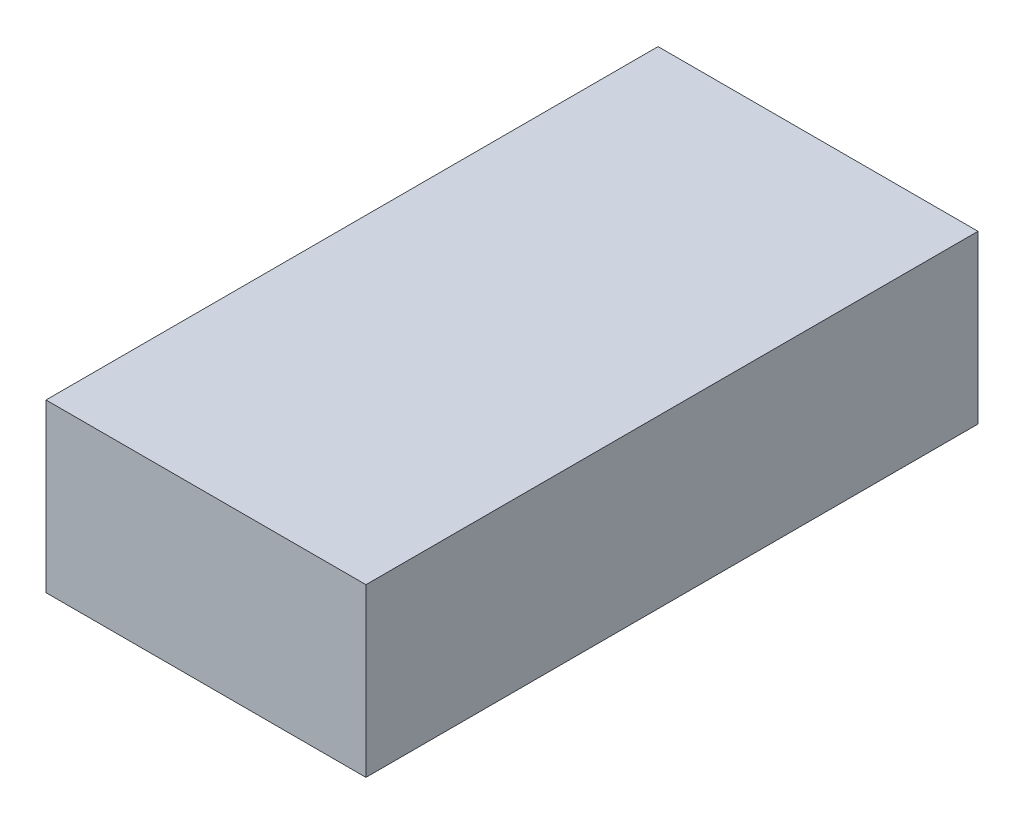
ISO-10303-21;
HEADER;
FILE_DESCRIPTION(('STEP AP214'),'2;1');
FILE_NAME('part.step','',(''),(''),'','','');
FILE_SCHEMA(('AUTOMOTIVE_DESIGN { 1 0 10303 214 1 1 1 1 }'));
ENDSEC;
DATA;
#1=APPLICATION_CONTEXT('core data for automotive mechanical design processes');
#2=APPLICATION_PROTOCOL_DEFINITION('international standard','automotive_design',2000,#1);
#3=PRODUCT_CONTEXT('',#1,'mechanical');
#4=PRODUCT('Part','Part','',(#3));
#5=PRODUCT_RELATED_PRODUCT_CATEGORY('part','',(#4));
#6=PRODUCT_DEFINITION_FORMATION('','',#4);
#7=PRODUCT_DEFINITION_CONTEXT('part definition',#1,'design');
#8=PRODUCT_DEFINITION('design','',#6,#7);
#9=PRODUCT_DEFINITION_SHAPE('','',#8);
#10=(LENGTH_UNIT() NAMED_UNIT(*) SI_UNIT(.MILLI.,.METRE.));
#11=(NAMED_UNIT(*) PLANE_ANGLE_UNIT() SI_UNIT($,.RADIAN.));
#12=(NAMED_UNIT(*) SI_UNIT($,.STERADIAN.) SOLID_ANGLE_UNIT());
#13=UNCERTAINTY_MEASURE_WITH_UNIT(LENGTH_MEASURE(1.E-05),#10,'distance_accuracy_value','');
#14=(GEOMETRIC_REPRESENTATION_CONTEXT(3) GLOBAL_UNCERTAINTY_ASSIGNED_CONTEXT((#13)) GLOBAL_UNIT_ASSIGNED_CONTEXT((#10,
#11,#12)) REPRESENTATION_CONTEXT('',''));
#15=CARTESIAN_POINT('',(0.,0.,0.));
#16=DIRECTION('',(0.,0.,1.));
#17=DIRECTION('',(1.,0.,0.));
#18=AXIS2_PLACEMENT_3D('',#15,#16,#17);
#19=CARTESIAN_POINT('',(0.,38.1,0.));
#20=DIRECTION('',(1.,0.,0.));
#21=DIRECTION('',(0.,0.,-1.));
#22=AXIS2_PLACEMENT_3D('',#19,#20,#21);
#23=PLANE('',#22);
#24=DIRECTION('',(0.,0.,1.));
#25=VECTOR('',#24,1.);
#26=CARTESIAN_POINT('',(0.,0.,0.));
#27=LINE('',#26,#25);
#28=CARTESIAN_POINT('',(0.,0.,-139.7));
#29=VERTEX_POINT('',#28);
#30=CARTESIAN_POINT('',(0.,0.,0.));
#31=VERTEX_POINT('',#30);
#32=EDGE_CURVE('E94',#29,#31,#27,.T.);
#33=ORIENTED_EDGE('',*,*,#32,.T.);
#34=DIRECTION('',(0.,-1.,0.));
#35=VECTOR('',#34,1.);
#36=CARTESIAN_POINT('',(0.,38.1,0.));
#37=LINE('',#36,#35);
#38=CARTESIAN_POINT('',(0.,38.1,0.));
#39=VERTEX_POINT('',#38);
#40=EDGE_CURVE('E11',#39,#31,#37,.T.);
#41=ORIENTED_EDGE('',*,*,#40,.F.);
#42=DIRECTION('',(0.,0.,1.));
#43=VECTOR('',#42,1.);
#44=CARTESIAN_POINT('',(0.,38.1,0.));
#45=LINE('',#44,#43);
#46=CARTESIAN_POINT('',(0.,38.1,-139.7));
#47=VERTEX_POINT('',#46);
#48=EDGE_CURVE('E82',#47,#39,#45,.T.);
#49=ORIENTED_EDGE('',*,*,#48,.F.);
#50=DIRECTION('',(0.,-1.,0.));
#51=VECTOR('',#50,1.);
#52=CARTESIAN_POINT('',(0.,38.1,-139.7));
#53=LINE('',#52,#51);
#54=EDGE_CURVE('E90',#47,#29,#53,.T.);
#55=ORIENTED_EDGE('',*,*,#54,.T.);
#56=EDGE_LOOP('',(#33,#41,#49,#55));
#57=FACE_BOUND('',#56,.T.);
#58=ADVANCED_FACE('F31',(#57),#23,.F.);
#59=CARTESIAN_POINT('',(0.,38.1,0.));
#60=DIRECTION('',(0.,0.,-1.));
#61=DIRECTION('',(-1.,0.,0.));
#62=AXIS2_PLACEMENT_3D('',#59,#60,#61);
#63=PLANE('',#62);
#64=DIRECTION('',(1.,0.,0.));
#65=VECTOR('',#64,1.);
#66=CARTESIAN_POINT('',(0.,0.,0.));
#67=LINE('',#66,#65);
#68=CARTESIAN_POINT('',(73.025,0.,0.));
#69=VERTEX_POINT('',#68);
#70=EDGE_CURVE('E86',#31,#69,#67,.T.);
#71=ORIENTED_EDGE('',*,*,#70,.T.);
#72=DIRECTION('',(0.,-1.,0.));
#73=VECTOR('',#72,1.);
#74=CARTESIAN_POINT('',(73.025,38.1,0.));
#75=LINE('',#74,#73);
#76=CARTESIAN_POINT('',(73.025,38.1,0.));
#77=VERTEX_POINT('',#76);
#78=EDGE_CURVE('E39',#77,#69,#75,.T.);
#79=ORIENTED_EDGE('',*,*,#78,.F.);
#80=DIRECTION('',(1.,0.,0.));
#81=VECTOR('',#80,1.);
#82=CARTESIAN_POINT('',(0.,38.1,0.));
#83=LINE('',#82,#81);
#84=EDGE_CURVE('E77',#39,#77,#83,.T.);
#85=ORIENTED_EDGE('',*,*,#84,.F.);
#86=ORIENTED_EDGE('',*,*,#40,.T.);
#87=EDGE_LOOP('',(#71,#79,#85,#86));
#88=FACE_BOUND('',#87,.T.);
#89=ADVANCED_FACE('F85',(#88),#63,.F.);
#90=CARTESIAN_POINT('',(73.025,38.1,0.));
#91=DIRECTION('',(-1.,0.,0.));
#92=DIRECTION('',(0.,0.,1.));
#93=AXIS2_PLACEMENT_3D('',#90,#91,#92);
#94=PLANE('',#93);
#95=DIRECTION('',(0.,0.,-1.));
#96=VECTOR('',#95,1.);
#97=CARTESIAN_POINT('',(73.025,0.,0.));
#98=LINE('',#97,#96);
#99=CARTESIAN_POINT('',(73.025,0.,-139.7));
#100=VERTEX_POINT('',#99);
#101=EDGE_CURVE('E64',#69,#100,#98,.T.);
#102=ORIENTED_EDGE('',*,*,#101,.T.);
#103=DIRECTION('',(0.,-1.,0.));
#104=VECTOR('',#103,1.);
#105=CARTESIAN_POINT('',(73.025,38.1,-139.7));
#106=LINE('',#105,#104);
#107=CARTESIAN_POINT('',(73.025,38.1,-139.7));
#108=VERTEX_POINT('',#107);
#109=EDGE_CURVE('E87',#108,#100,#106,.T.);
#110=ORIENTED_EDGE('',*,*,#109,.F.);
#111=DIRECTION('',(0.,0.,-1.));
#112=VECTOR('',#111,1.);
#113=CARTESIAN_POINT('',(73.025,38.1,0.));
#114=LINE('',#113,#112);
#115=EDGE_CURVE('E80',#77,#108,#114,.T.);
#116=ORIENTED_EDGE('',*,*,#115,.F.);
#117=ORIENTED_EDGE('',*,*,#78,.T.);
#118=EDGE_LOOP('',(#102,#110,#116,#117));
#119=FACE_BOUND('',#118,.T.);
#120=ADVANCED_FACE('F88',(#119),#94,.F.);
#121=CARTESIAN_POINT('',(0.,38.1,-139.7));
#122=DIRECTION('',(0.,0.,1.));
#123=DIRECTION('',(1.,0.,0.));
#124=AXIS2_PLACEMENT_3D('',#121,#122,#123);
#125=PLANE('',#124);
#126=DIRECTION('',(-1.,0.,0.));
#127=VECTOR('',#126,1.);
#128=CARTESIAN_POINT('',(0.,0.,-139.7));
#129=LINE('',#128,#127);
#130=EDGE_CURVE('E70',#100,#29,#129,.T.);
#131=ORIENTED_EDGE('',*,*,#130,.T.);
#132=ORIENTED_EDGE('',*,*,#54,.F.);
#133=DIRECTION('',(-1.,0.,0.));
#134=VECTOR('',#133,1.);
#135=CARTESIAN_POINT('',(0.,38.1,-139.7));
#136=LINE('',#135,#134);
#137=EDGE_CURVE('E47',#108,#47,#136,.T.);
#138=ORIENTED_EDGE('',*,*,#137,.F.);
#139=ORIENTED_EDGE('',*,*,#109,.T.);
#140=EDGE_LOOP('',(#131,#132,#138,#139));
#141=FACE_BOUND('',#140,.T.);
#142=ADVANCED_FACE('F101',(#141),#125,.F.);
#143=CARTESIAN_POINT('',(0.,38.1,-139.7));
#144=DIRECTION('',(0.,-1.,0.));
#145=DIRECTION('',(0.,0.,-1.));
#146=AXIS2_PLACEMENT_3D('',#143,#144,#145);
#147=PLANE('',#146);
#148=ORIENTED_EDGE('',*,*,#48,.T.);
#149=ORIENTED_EDGE('',*,*,#84,.T.);
#150=ORIENTED_EDGE('',*,*,#115,.T.);
#151=ORIENTED_EDGE('',*,*,#137,.T.);
#152=EDGE_LOOP('',(#148,#149,#150,#151));
#153=FACE_BOUND('',#152,.T.);
#154=ADVANCED_FACE('F78',(#153),#147,.F.);
#155=CARTESIAN_POINT('',(0.,0.,-139.7));
#156=DIRECTION('',(0.,-1.,0.));
#157=DIRECTION('',(0.,0.,-1.));
#158=AXIS2_PLACEMENT_3D('',#155,#156,#157);
#159=PLANE('',#158);
#160=ORIENTED_EDGE('',*,*,#32,.F.);
#161=ORIENTED_EDGE('',*,*,#130,.F.);
#162=ORIENTED_EDGE('',*,*,#101,.F.);
#163=ORIENTED_EDGE('',*,*,#70,.F.);
#164=EDGE_LOOP('',(#160,#161,#162,#163));
#165=FACE_BOUND('',#164,.T.);
#166=ADVANCED_FACE('F104',(#165),#159,.T.);
#167=CLOSED_SHELL('',(#58,#89,#120,#142,#154,#166));
#168=MANIFOLD_SOLID_BREP('B2',#167);
#169=ADVANCED_BREP_SHAPE_REPRESENTATION('',(#18,#168),#14);
#170=SHAPE_DEFINITION_REPRESENTATION(#9,#169);
ENDSEC;
END-ISO-10303-21;
